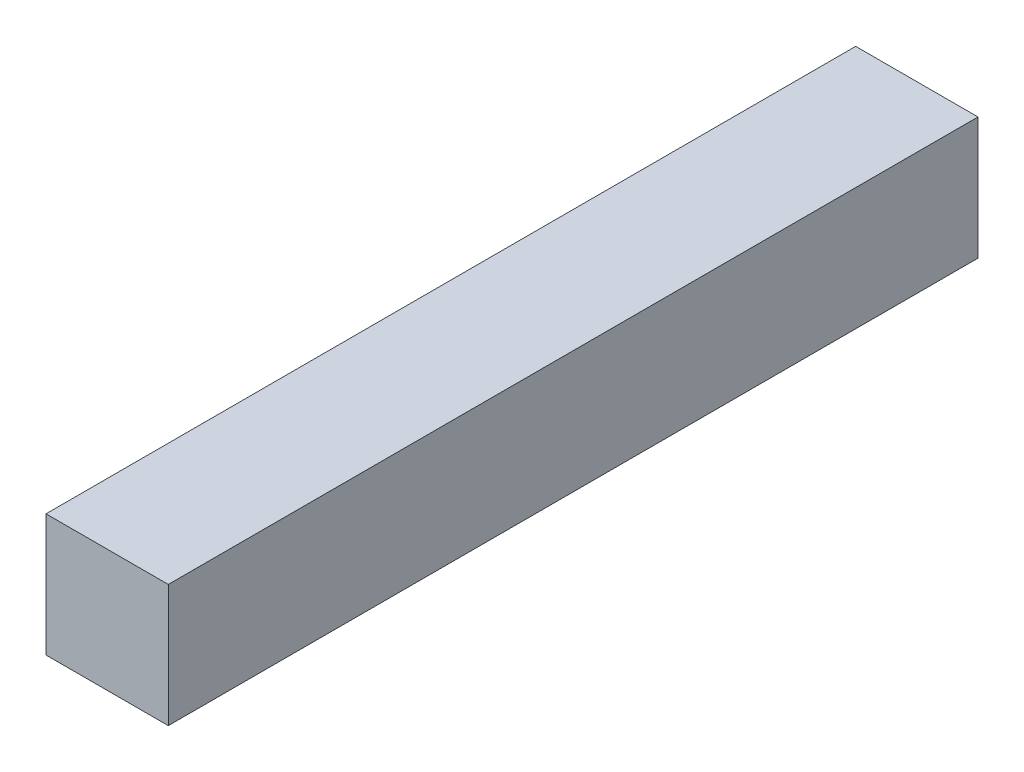
ISO-10303-21;
HEADER;
FILE_DESCRIPTION(('STEP AP214'),'2;1');
FILE_NAME('part.step','',(''),(''),'','','');
FILE_SCHEMA(('AUTOMOTIVE_DESIGN { 1 0 10303 214 1 1 1 1 }'));
ENDSEC;
DATA;
#1=APPLICATION_CONTEXT('core data for automotive mechanical design processes');
#2=APPLICATION_PROTOCOL_DEFINITION('international standard','automotive_design',2000,#1);
#3=PRODUCT_CONTEXT('',#1,'mechanical');
#4=PRODUCT('Part','Part','',(#3));
#5=PRODUCT_RELATED_PRODUCT_CATEGORY('part','',(#4));
#6=PRODUCT_DEFINITION_FORMATION('','',#4);
#7=PRODUCT_DEFINITION_CONTEXT('part definition',#1,'design');
#8=PRODUCT_DEFINITION('design','',#6,#7);
#9=PRODUCT_DEFINITION_SHAPE('','',#8);
#10=(LENGTH_UNIT() NAMED_UNIT(*) SI_UNIT(.MILLI.,.METRE.));
#11=(NAMED_UNIT(*) PLANE_ANGLE_UNIT() SI_UNIT($,.RADIAN.));
#12=(NAMED_UNIT(*) SI_UNIT($,.STERADIAN.) SOLID_ANGLE_UNIT());
#13=UNCERTAINTY_MEASURE_WITH_UNIT(LENGTH_MEASURE(1.E-05),#10,'distance_accuracy_value','');
#14=(GEOMETRIC_REPRESENTATION_CONTEXT(3) GLOBAL_UNCERTAINTY_ASSIGNED_CONTEXT((#13)) GLOBAL_UNIT_ASSIGNED_CONTEXT((#10,
#11,#12)) REPRESENTATION_CONTEXT('',''));
#15=CARTESIAN_POINT('',(0.,0.,0.));
#16=DIRECTION('',(0.,0.,1.));
#17=DIRECTION('',(1.,0.,0.));
#18=AXIS2_PLACEMENT_3D('',#15,#16,#17);
#19=CARTESIAN_POINT('',(0.,0.,0.));
#20=DIRECTION('',(0.,0.,1.));
#21=DIRECTION('',(1.,0.,0.));
#22=AXIS2_PLACEMENT_3D('',#19,#20,#21);
#23=PLANE('',#22);
#24=DIRECTION('',(0.,-1.,0.));
#25=VECTOR('',#24,1.);
#26=CARTESIAN_POINT('',(-5.,5.,0.));
#27=LINE('',#26,#25);
#28=CARTESIAN_POINT('',(-5.,5.,0.));
#29=VERTEX_POINT('',#28);
#30=CARTESIAN_POINT('',(-5.,-5.,0.));
#31=VERTEX_POINT('',#30);
#32=EDGE_CURVE('E84',#29,#31,#27,.T.);
#33=ORIENTED_EDGE('',*,*,#32,.F.);
#34=DIRECTION('',(-1.,0.,0.));
#35=VECTOR('',#34,1.);
#36=CARTESIAN_POINT('',(-5.,5.,0.));
#37=LINE('',#36,#35);
#38=CARTESIAN_POINT('',(5.,5.,0.));
#39=VERTEX_POINT('',#38);
#40=EDGE_CURVE('E95',#39,#29,#37,.T.);
#41=ORIENTED_EDGE('',*,*,#40,.F.);
#42=DIRECTION('',(0.,1.,0.));
#43=VECTOR('',#42,1.);
#44=CARTESIAN_POINT('',(5.,5.,0.));
#45=LINE('',#44,#43);
#46=CARTESIAN_POINT('',(5.,-5.,0.));
#47=VERTEX_POINT('',#46);
#48=EDGE_CURVE('E86',#47,#39,#45,.T.);
#49=ORIENTED_EDGE('',*,*,#48,.F.);
#50=DIRECTION('',(1.,0.,0.));
#51=VECTOR('',#50,1.);
#52=CARTESIAN_POINT('',(-5.,-5.,0.));
#53=LINE('',#52,#51);
#54=EDGE_CURVE('E76',#31,#47,#53,.T.);
#55=ORIENTED_EDGE('',*,*,#54,.F.);
#56=EDGE_LOOP('',(#33,#41,#49,#55));
#57=FACE_BOUND('',#56,.T.);
#58=ADVANCED_FACE('F34',(#57),#23,.F.);
#59=CARTESIAN_POINT('',(-5.,5.,82.3421356237315));
#60=DIRECTION('',(0.,-1.,0.));
#61=DIRECTION('',(0.,0.,-1.));
#62=AXIS2_PLACEMENT_3D('',#59,#60,#61);
#63=PLANE('',#62);
#64=DIRECTION('',(0.,0.,-1.));
#65=VECTOR('',#64,1.);
#66=CARTESIAN_POINT('',(-5.,5.,82.3421356237315));
#67=LINE('',#66,#65);
#68=CARTESIAN_POINT('',(-5.,5.,66.2000000000005));
#69=VERTEX_POINT('',#68);
#70=EDGE_CURVE('E89',#69,#29,#67,.T.);
#71=ORIENTED_EDGE('',*,*,#70,.F.);
#72=DIRECTION('',(1.,0.,0.));
#73=VECTOR('',#72,1.);
#74=CARTESIAN_POINT('',(-5.,5.,66.2000000000005));
#75=LINE('',#74,#73);
#76=CARTESIAN_POINT('',(5.,5.,66.2000000000005));
#77=VERTEX_POINT('',#76);
#78=EDGE_CURVE('E38',#69,#77,#75,.T.);
#79=ORIENTED_EDGE('',*,*,#78,.T.);
#80=DIRECTION('',(0.,0.,-1.));
#81=VECTOR('',#80,1.);
#82=CARTESIAN_POINT('',(5.,5.,82.3421356237315));
#83=LINE('',#82,#81);
#84=EDGE_CURVE('E98',#77,#39,#83,.T.);
#85=ORIENTED_EDGE('',*,*,#84,.T.);
#86=ORIENTED_EDGE('',*,*,#40,.T.);
#87=EDGE_LOOP('',(#71,#79,#85,#86));
#88=FACE_BOUND('',#87,.T.);
#89=ADVANCED_FACE('F107',(#88),#63,.F.);
#90=CARTESIAN_POINT('',(5.,5.,82.3421356237315));
#91=DIRECTION('',(-1.,0.,0.));
#92=DIRECTION('',(0.,-1.,0.));
#93=AXIS2_PLACEMENT_3D('',#90,#91,#92);
#94=PLANE('',#93);
#95=ORIENTED_EDGE('',*,*,#84,.F.);
#96=DIRECTION('',(0.,-1.,0.));
#97=VECTOR('',#96,1.);
#98=CARTESIAN_POINT('',(5.,5.,66.2000000000005));
#99=LINE('',#98,#97);
#100=CARTESIAN_POINT('',(5.,-5.,66.2000000000005));
#101=VERTEX_POINT('',#100);
#102=EDGE_CURVE('E104',#77,#101,#99,.T.);
#103=ORIENTED_EDGE('',*,*,#102,.T.);
#104=DIRECTION('',(0.,0.,-1.));
#105=VECTOR('',#104,1.);
#106=CARTESIAN_POINT('',(5.,-5.,82.3421356237315));
#107=LINE('',#106,#105);
#108=EDGE_CURVE('E80',#101,#47,#107,.T.);
#109=ORIENTED_EDGE('',*,*,#108,.T.);
#110=ORIENTED_EDGE('',*,*,#48,.T.);
#111=EDGE_LOOP('',(#95,#103,#109,#110));
#112=FACE_BOUND('',#111,.T.);
#113=ADVANCED_FACE('F103',(#112),#94,.F.);
#114=CARTESIAN_POINT('',(-5.,-5.,82.3421356237315));
#115=DIRECTION('',(0.,1.,0.));
#116=DIRECTION('',(0.,0.,1.));
#117=AXIS2_PLACEMENT_3D('',#114,#115,#116);
#118=PLANE('',#117);
#119=ORIENTED_EDGE('',*,*,#108,.F.);
#120=DIRECTION('',(-1.,0.,0.));
#121=VECTOR('',#120,1.);
#122=CARTESIAN_POINT('',(-5.,-5.,66.2000000000005));
#123=LINE('',#122,#121);
#124=CARTESIAN_POINT('',(-5.,-5.,66.2000000000005));
#125=VERTEX_POINT('',#124);
#126=EDGE_CURVE('E43',#101,#125,#123,.T.);
#127=ORIENTED_EDGE('',*,*,#126,.T.);
#128=DIRECTION('',(0.,0.,-1.));
#129=VECTOR('',#128,1.);
#130=CARTESIAN_POINT('',(-5.,-5.,82.3421356237315));
#131=LINE('',#130,#129);
#132=EDGE_CURVE('E73',#125,#31,#131,.T.);
#133=ORIENTED_EDGE('',*,*,#132,.T.);
#134=ORIENTED_EDGE('',*,*,#54,.T.);
#135=EDGE_LOOP('',(#119,#127,#133,#134));
#136=FACE_BOUND('',#135,.T.);
#137=ADVANCED_FACE('F75',(#136),#118,.F.);
#138=CARTESIAN_POINT('',(-5.,5.,82.3421356237315));
#139=DIRECTION('',(1.,0.,0.));
#140=DIRECTION('',(0.,1.,0.));
#141=AXIS2_PLACEMENT_3D('',#138,#139,#140);
#142=PLANE('',#141);
#143=ORIENTED_EDGE('',*,*,#132,.F.);
#144=DIRECTION('',(0.,1.,0.));
#145=VECTOR('',#144,1.);
#146=CARTESIAN_POINT('',(-5.,5.,66.2000000000005));
#147=LINE('',#146,#145);
#148=EDGE_CURVE('E12',#125,#69,#147,.T.);
#149=ORIENTED_EDGE('',*,*,#148,.T.);
#150=ORIENTED_EDGE('',*,*,#70,.T.);
#151=ORIENTED_EDGE('',*,*,#32,.T.);
#152=EDGE_LOOP('',(#143,#149,#150,#151));
#153=FACE_BOUND('',#152,.T.);
#154=ADVANCED_FACE('F36',(#153),#142,.F.);
#155=CARTESIAN_POINT('',(-5.00000000000002,-155.2,66.2000000000005));
#156=DIRECTION('',(0.,0.,-1.));
#157=DIRECTION('',(0.,1.,0.));
#158=AXIS2_PLACEMENT_3D('',#155,#156,#157);
#159=PLANE('',#158);
#160=ORIENTED_EDGE('',*,*,#126,.F.);
#161=ORIENTED_EDGE('',*,*,#102,.F.);
#162=ORIENTED_EDGE('',*,*,#78,.F.);
#163=ORIENTED_EDGE('',*,*,#148,.F.);
#164=EDGE_LOOP('',(#160,#161,#162,#163));
#165=FACE_BOUND('',#164,.T.);
#166=ADVANCED_FACE('F121',(#165),#159,.F.);
#167=CLOSED_SHELL('',(#58,#89,#113,#137,#154,#166));
#168=MANIFOLD_SOLID_BREP('B2',#167);
#169=ADVANCED_BREP_SHAPE_REPRESENTATION('',(#18,#168),#14);
#170=SHAPE_DEFINITION_REPRESENTATION(#9,#169);
ENDSEC;
END-ISO-10303-21;
